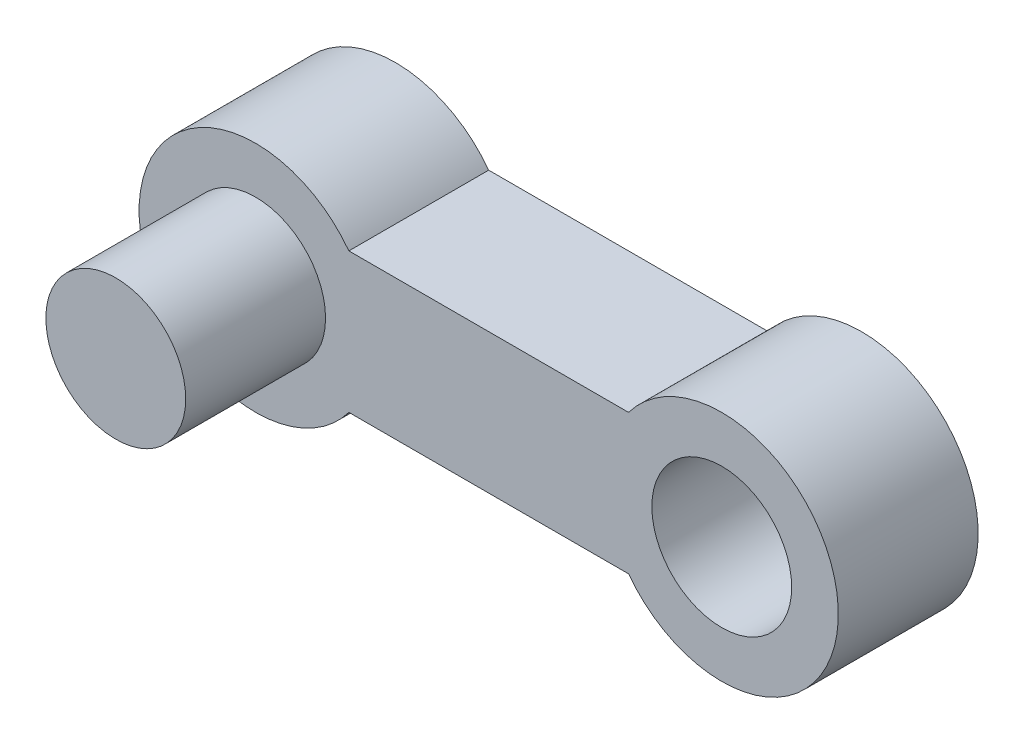
ISO-10303-21;
HEADER;
FILE_DESCRIPTION(('STEP AP214'),'2;1');
FILE_NAME('part.step','',(''),(''),'','','');
FILE_SCHEMA(('AUTOMOTIVE_DESIGN { 1 0 10303 214 1 1 1 1 }'));
ENDSEC;
DATA;
#1=APPLICATION_CONTEXT('core data for automotive mechanical design processes');
#2=APPLICATION_PROTOCOL_DEFINITION('international standard','automotive_design',2000,#1);
#3=PRODUCT_CONTEXT('',#1,'mechanical');
#4=PRODUCT('Part','Part','',(#3));
#5=PRODUCT_RELATED_PRODUCT_CATEGORY('part','',(#4));
#6=PRODUCT_DEFINITION_FORMATION('','',#4);
#7=PRODUCT_DEFINITION_CONTEXT('part definition',#1,'design');
#8=PRODUCT_DEFINITION('design','',#6,#7);
#9=PRODUCT_DEFINITION_SHAPE('','',#8);
#10=(LENGTH_UNIT() NAMED_UNIT(*) SI_UNIT(.MILLI.,.METRE.));
#11=(NAMED_UNIT(*) PLANE_ANGLE_UNIT() SI_UNIT($,.RADIAN.));
#12=(NAMED_UNIT(*) SI_UNIT($,.STERADIAN.) SOLID_ANGLE_UNIT());
#13=UNCERTAINTY_MEASURE_WITH_UNIT(LENGTH_MEASURE(1.E-05),#10,'distance_accuracy_value','');
#14=(GEOMETRIC_REPRESENTATION_CONTEXT(3) GLOBAL_UNCERTAINTY_ASSIGNED_CONTEXT((#13)) GLOBAL_UNIT_ASSIGNED_CONTEXT((#10,
#11,#12)) REPRESENTATION_CONTEXT('',''));
#15=CARTESIAN_POINT('',(0.,0.,0.));
#16=DIRECTION('',(0.,0.,1.));
#17=DIRECTION('',(1.,0.,0.));
#18=AXIS2_PLACEMENT_3D('',#15,#16,#17);
#19=CARTESIAN_POINT('',(0.,0.,0.));
#20=DIRECTION('',(0.,0.,1.));
#21=DIRECTION('',(1.,0.,0.));
#22=AXIS2_PLACEMENT_3D('',#19,#20,#21);
#23=PLANE('',#22);
#24=CARTESIAN_POINT('',(-16.8666859997444,13.4242087019071,0.));
#25=DIRECTION('',(0.,0.,-1.));
#26=DIRECTION('',(-1.,0.,0.));
#27=AXIS2_PLACEMENT_3D('',#24,#25,#26);
#28=CIRCLE('',#27,1.5);
#29=CARTESIAN_POINT('',(-18.3666859997444,13.4242087019071,0.));
#30=VERTEX_POINT('',#29);
#31=EDGE_CURVE('E210',#30,#30,#28,.T.);
#32=ORIENTED_EDGE('',*,*,#31,.F.);
#33=EDGE_LOOP('',(#32));
#34=FACE_BOUND('',#33,.T.);
#35=CARTESIAN_POINT('',(-26.8666859997444,13.4242087019071,0.));
#36=DIRECTION('',(0.,0.,1.));
#37=DIRECTION('',(1.,0.,0.));
#38=AXIS2_PLACEMENT_3D('',#35,#36,#37);
#39=CIRCLE('',#38,2.5);
#40=CARTESIAN_POINT('',(-24.8666859997444,14.9242087019071,0.));
#41=VERTEX_POINT('',#40);
#42=CARTESIAN_POINT('',(-24.8666859997444,11.9242087019071,0.));
#43=VERTEX_POINT('',#42);
#44=EDGE_CURVE('E184',#41,#43,#39,.T.);
#45=ORIENTED_EDGE('',*,*,#44,.F.);
#46=DIRECTION('',(1.,0.,0.));
#47=VECTOR('',#46,1.);
#48=CARTESIAN_POINT('',(0.,14.9242087019071,0.));
#49=LINE('',#48,#47);
#50=CARTESIAN_POINT('',(-18.8666859997444,14.9242087019071,0.));
#51=VERTEX_POINT('',#50);
#52=EDGE_CURVE('E173',#41,#51,#49,.T.);
#53=ORIENTED_EDGE('',*,*,#52,.T.);
#54=CARTESIAN_POINT('',(-16.8666859997444,13.4242087019071,0.));
#55=DIRECTION('',(0.,0.,1.));
#56=DIRECTION('',(1.,0.,0.));
#57=AXIS2_PLACEMENT_3D('',#54,#55,#56);
#58=CIRCLE('',#57,2.5);
#59=CARTESIAN_POINT('',(-18.8666859997444,11.9242087019071,0.));
#60=VERTEX_POINT('',#59);
#61=EDGE_CURVE('E129',#51,#60,#58,.F.);
#62=ORIENTED_EDGE('',*,*,#61,.T.);
#63=DIRECTION('',(1.,0.,0.));
#64=VECTOR('',#63,1.);
#65=CARTESIAN_POINT('',(0.,11.9242087019071,0.));
#66=LINE('',#65,#64);
#67=EDGE_CURVE('E186',#43,#60,#66,.T.);
#68=ORIENTED_EDGE('',*,*,#67,.F.);
#69=EDGE_LOOP('',(#45,#53,#62,#68));
#70=FACE_BOUND('',#69,.T.);
#71=ADVANCED_FACE('F125',(#34,#70),#23,.F.);
#72=CARTESIAN_POINT('',(-26.8666859997444,13.4242087019071,3.));
#73=DIRECTION('',(0.,0.,-1.));
#74=DIRECTION('',(-1.,0.,0.));
#75=AXIS2_PLACEMENT_3D('',#72,#73,#74);
#76=CYLINDRICAL_SURFACE('',#75,2.5);
#77=ORIENTED_EDGE('',*,*,#44,.T.);
#78=DIRECTION('',(0.,0.,-1.));
#79=VECTOR('',#78,1.);
#80=CARTESIAN_POINT('',(-24.8666859997444,11.9242087019071,3.));
#81=LINE('',#80,#79);
#82=CARTESIAN_POINT('',(-24.8666859997444,11.9242087019071,3.));
#83=VERTEX_POINT('',#82);
#84=EDGE_CURVE('E144',#83,#43,#81,.T.);
#85=ORIENTED_EDGE('',*,*,#84,.F.);
#86=CARTESIAN_POINT('',(-26.8666859997444,13.4242087019071,3.));
#87=DIRECTION('',(0.,0.,1.));
#88=DIRECTION('',(1.,0.,0.));
#89=AXIS2_PLACEMENT_3D('',#86,#87,#88);
#90=CIRCLE('',#89,2.5);
#91=CARTESIAN_POINT('',(-24.8666859997444,14.9242087019071,3.));
#92=VERTEX_POINT('',#91);
#93=EDGE_CURVE('E196',#92,#83,#90,.T.);
#94=ORIENTED_EDGE('',*,*,#93,.F.);
#95=DIRECTION('',(0.,0.,-1.));
#96=VECTOR('',#95,1.);
#97=CARTESIAN_POINT('',(-24.8666859997444,14.9242087019071,3.));
#98=LINE('',#97,#96);
#99=EDGE_CURVE('E135',#92,#41,#98,.T.);
#100=ORIENTED_EDGE('',*,*,#99,.T.);
#101=EDGE_LOOP('',(#77,#85,#94,#100));
#102=FACE_BOUND('',#101,.T.);
#103=ADVANCED_FACE('F199',(#102),#76,.T.);
#104=CARTESIAN_POINT('',(0.,0.,3.));
#105=DIRECTION('',(0.,0.,1.));
#106=DIRECTION('',(1.,0.,0.));
#107=AXIS2_PLACEMENT_3D('',#104,#105,#106);
#108=PLANE('',#107);
#109=CARTESIAN_POINT('',(-16.8666859997444,13.4242087019071,3.));
#110=DIRECTION('',(0.,0.,1.));
#111=DIRECTION('',(1.,0.,0.));
#112=AXIS2_PLACEMENT_3D('',#109,#110,#111);
#113=CIRCLE('',#112,1.5);
#114=CARTESIAN_POINT('',(-15.3666859997444,13.4242087019071,3.));
#115=VERTEX_POINT('',#114);
#116=EDGE_CURVE('E207',#115,#115,#113,.F.);
#117=ORIENTED_EDGE('',*,*,#116,.T.);
#118=EDGE_LOOP('',(#117));
#119=FACE_BOUND('',#118,.T.);
#120=CARTESIAN_POINT('',(-26.8666859997444,13.4242087019071,3.));
#121=DIRECTION('',(0.,0.,1.));
#122=DIRECTION('',(1.,0.,0.));
#123=AXIS2_PLACEMENT_3D('',#120,#121,#122);
#124=CIRCLE('',#123,1.5);
#125=CARTESIAN_POINT('',(-25.3666859997444,13.4242087019071,3.));
#126=VERTEX_POINT('',#125);
#127=EDGE_CURVE('E12',#126,#126,#124,.T.);
#128=ORIENTED_EDGE('',*,*,#127,.F.);
#129=EDGE_LOOP('',(#128));
#130=FACE_BOUND('',#129,.T.);
#131=ORIENTED_EDGE('',*,*,#93,.T.);
#132=DIRECTION('',(1.,0.,0.));
#133=VECTOR('',#132,1.);
#134=CARTESIAN_POINT('',(0.,11.9242087019071,3.));
#135=LINE('',#134,#133);
#136=CARTESIAN_POINT('',(-18.8666859997444,11.9242087019071,3.));
#137=VERTEX_POINT('',#136);
#138=EDGE_CURVE('E185',#83,#137,#135,.T.);
#139=ORIENTED_EDGE('',*,*,#138,.T.);
#140=CARTESIAN_POINT('',(-16.8666859997444,13.4242087019071,3.));
#141=DIRECTION('',(0.,0.,1.));
#142=DIRECTION('',(1.,0.,0.));
#143=AXIS2_PLACEMENT_3D('',#140,#141,#142);
#144=CIRCLE('',#143,2.5);
#145=CARTESIAN_POINT('',(-18.8666859997444,14.9242087019071,3.));
#146=VERTEX_POINT('',#145);
#147=EDGE_CURVE('E182',#146,#137,#144,.F.);
#148=ORIENTED_EDGE('',*,*,#147,.F.);
#149=DIRECTION('',(1.,0.,0.));
#150=VECTOR('',#149,1.);
#151=CARTESIAN_POINT('',(0.,14.9242087019071,3.));
#152=LINE('',#151,#150);
#153=EDGE_CURVE('E176',#92,#146,#152,.T.);
#154=ORIENTED_EDGE('',*,*,#153,.F.);
#155=EDGE_LOOP('',(#131,#139,#148,#154));
#156=FACE_BOUND('',#155,.T.);
#157=ADVANCED_FACE('F195',(#119,#130,#156),#108,.T.);
#158=CARTESIAN_POINT('',(-16.8666859997444,13.4242087019071,3.));
#159=DIRECTION('',(0.,0.,-1.));
#160=DIRECTION('',(-1.,0.,0.));
#161=AXIS2_PLACEMENT_3D('',#158,#159,#160);
#162=CYLINDRICAL_SURFACE('',#161,2.5);
#163=ORIENTED_EDGE('',*,*,#61,.F.);
#164=DIRECTION('',(0.,0.,-1.));
#165=VECTOR('',#164,1.);
#166=CARTESIAN_POINT('',(-18.8666859997444,14.9242087019071,3.));
#167=LINE('',#166,#165);
#168=EDGE_CURVE('E170',#146,#51,#167,.T.);
#169=ORIENTED_EDGE('',*,*,#168,.F.);
#170=ORIENTED_EDGE('',*,*,#147,.T.);
#171=DIRECTION('',(0.,0.,-1.));
#172=VECTOR('',#171,1.);
#173=CARTESIAN_POINT('',(-18.8666859997444,11.9242087019071,3.));
#174=LINE('',#173,#172);
#175=EDGE_CURVE('E164',#137,#60,#174,.T.);
#176=ORIENTED_EDGE('',*,*,#175,.T.);
#177=EDGE_LOOP('',(#163,#169,#170,#176));
#178=FACE_BOUND('',#177,.T.);
#179=ADVANCED_FACE('F127',(#178),#162,.T.);
#180=CARTESIAN_POINT('',(0.,11.9242087019071,3.));
#181=DIRECTION('',(0.,1.,0.));
#182=DIRECTION('',(0.,0.,1.));
#183=AXIS2_PLACEMENT_3D('',#180,#181,#182);
#184=PLANE('',#183);
#185=ORIENTED_EDGE('',*,*,#67,.T.);
#186=ORIENTED_EDGE('',*,*,#175,.F.);
#187=ORIENTED_EDGE('',*,*,#138,.F.);
#188=ORIENTED_EDGE('',*,*,#84,.T.);
#189=EDGE_LOOP('',(#185,#186,#187,#188));
#190=FACE_BOUND('',#189,.T.);
#191=ADVANCED_FACE('F198',(#190),#184,.F.);
#192=CARTESIAN_POINT('',(0.,14.9242087019071,3.));
#193=DIRECTION('',(0.,1.,0.));
#194=DIRECTION('',(0.,0.,1.));
#195=AXIS2_PLACEMENT_3D('',#192,#193,#194);
#196=PLANE('',#195);
#197=ORIENTED_EDGE('',*,*,#52,.F.);
#198=ORIENTED_EDGE('',*,*,#99,.F.);
#199=ORIENTED_EDGE('',*,*,#153,.T.);
#200=ORIENTED_EDGE('',*,*,#168,.T.);
#201=EDGE_LOOP('',(#197,#198,#199,#200));
#202=FACE_BOUND('',#201,.T.);
#203=ADVANCED_FACE('F171',(#202),#196,.T.);
#204=CARTESIAN_POINT('',(-26.8666859997444,13.4242087019071,6.));
#205=DIRECTION('',(0.,0.,-1.));
#206=DIRECTION('',(-1.,0.,0.));
#207=AXIS2_PLACEMENT_3D('',#204,#205,#206);
#208=CYLINDRICAL_SURFACE('',#207,1.5);
#209=CARTESIAN_POINT('',(-26.8666859997444,13.4242087019071,6.));
#210=DIRECTION('',(0.,0.,1.));
#211=DIRECTION('',(1.,0.,0.));
#212=AXIS2_PLACEMENT_3D('',#209,#210,#211);
#213=CIRCLE('',#212,1.5);
#214=CARTESIAN_POINT('',(-25.3666859997444,13.4242087019071,6.));
#215=VERTEX_POINT('',#214);
#216=EDGE_CURVE('E183',#215,#215,#213,.T.);
#217=ORIENTED_EDGE('',*,*,#216,.F.);
#218=EDGE_LOOP('',(#217));
#219=FACE_BOUND('',#218,.T.);
#220=ORIENTED_EDGE('',*,*,#127,.T.);
#221=EDGE_LOOP('',(#220));
#222=FACE_BOUND('',#221,.T.);
#223=ADVANCED_FACE('F230',(#219,#222),#208,.T.);
#224=CARTESIAN_POINT('',(-26.8666859997444,13.4242087019071,6.));
#225=DIRECTION('',(0.,0.,1.));
#226=DIRECTION('',(1.,0.,0.));
#227=AXIS2_PLACEMENT_3D('',#224,#225,#226);
#228=PLANE('',#227);
#229=ORIENTED_EDGE('',*,*,#216,.T.);
#230=EDGE_LOOP('',(#229));
#231=FACE_BOUND('',#230,.T.);
#232=ADVANCED_FACE('F236',(#231),#228,.T.);
#233=CARTESIAN_POINT('',(-16.8666859997444,13.4242087019071,7.2426406871193));
#234=DIRECTION('',(0.,0.,-1.));
#235=DIRECTION('',(-1.,0.,0.));
#236=AXIS2_PLACEMENT_3D('',#233,#234,#235);
#237=CYLINDRICAL_SURFACE('',#236,1.5);
#238=ORIENTED_EDGE('',*,*,#31,.T.);
#239=EDGE_LOOP('',(#238));
#240=FACE_BOUND('',#239,.T.);
#241=ORIENTED_EDGE('',*,*,#116,.F.);
#242=EDGE_LOOP('',(#241));
#243=FACE_BOUND('',#242,.T.);
#244=ADVANCED_FACE('F214',(#240,#243),#237,.F.);
#245=CLOSED_SHELL('',(#71,#103,#157,#179,#191,#203,#223,#232,#244));
#246=MANIFOLD_SOLID_BREP('B2',#245);
#247=ADVANCED_BREP_SHAPE_REPRESENTATION('',(#18,#246),#14);
#248=SHAPE_DEFINITION_REPRESENTATION(#9,#247);
ENDSEC;
END-ISO-10303-21;
